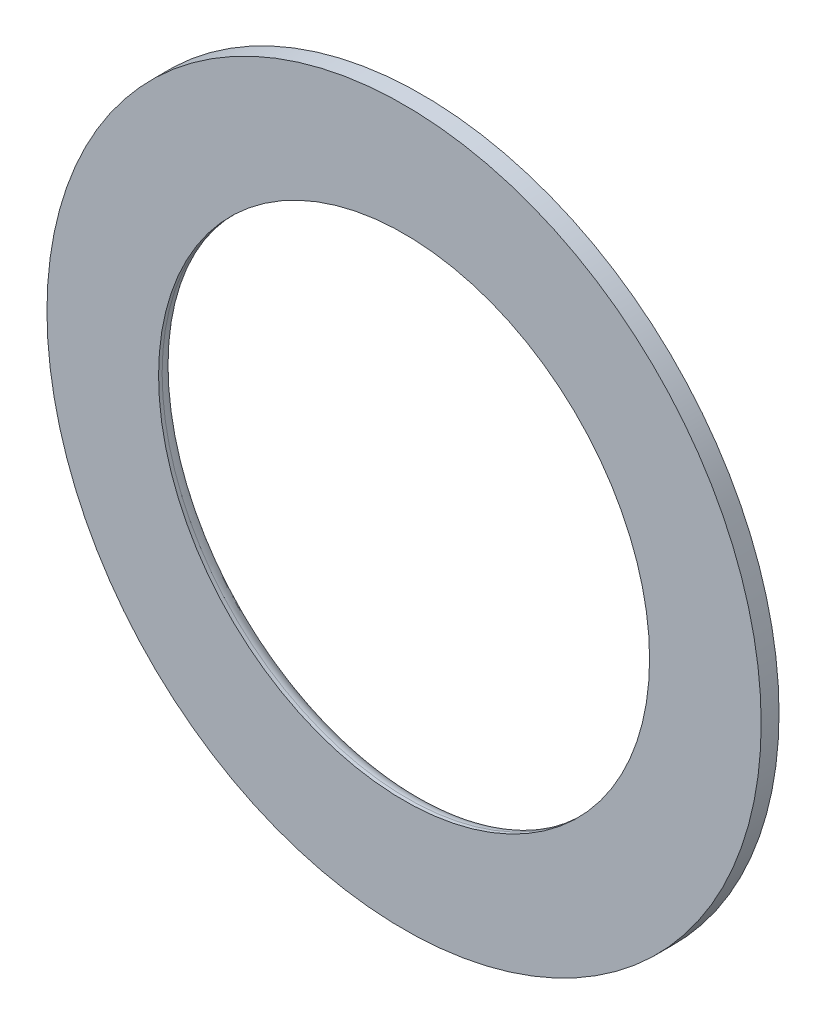
ISO-10303-21;
HEADER;
FILE_DESCRIPTION(('STEP AP214'),'2;1');
FILE_NAME('part.step','',(''),(''),'','','');
FILE_SCHEMA(('AUTOMOTIVE_DESIGN { 1 0 10303 214 1 1 1 1 }'));
ENDSEC;
DATA;
#1=APPLICATION_CONTEXT('core data for automotive mechanical design processes');
#2=APPLICATION_PROTOCOL_DEFINITION('international standard','automotive_design',2000,#1);
#3=PRODUCT_CONTEXT('',#1,'mechanical');
#4=PRODUCT('Part','Part','',(#3));
#5=PRODUCT_RELATED_PRODUCT_CATEGORY('part','',(#4));
#6=PRODUCT_DEFINITION_FORMATION('','',#4);
#7=PRODUCT_DEFINITION_CONTEXT('part definition',#1,'design');
#8=PRODUCT_DEFINITION('design','',#6,#7);
#9=PRODUCT_DEFINITION_SHAPE('','',#8);
#10=(LENGTH_UNIT() NAMED_UNIT(*) SI_UNIT(.MILLI.,.METRE.));
#11=(NAMED_UNIT(*) PLANE_ANGLE_UNIT() SI_UNIT($,.RADIAN.));
#12=(NAMED_UNIT(*) SI_UNIT($,.STERADIAN.) SOLID_ANGLE_UNIT());
#13=UNCERTAINTY_MEASURE_WITH_UNIT(LENGTH_MEASURE(1.E-05),#10,'distance_accuracy_value','');
#14=(GEOMETRIC_REPRESENTATION_CONTEXT(3) GLOBAL_UNCERTAINTY_ASSIGNED_CONTEXT((#13)) GLOBAL_UNIT_ASSIGNED_CONTEXT((#10,
#11,#12)) REPRESENTATION_CONTEXT('',''));
#15=CARTESIAN_POINT('',(0.,0.,0.));
#16=DIRECTION('',(0.,0.,1.));
#17=DIRECTION('',(1.,0.,0.));
#18=AXIS2_PLACEMENT_3D('',#15,#16,#17);
#19=CARTESIAN_POINT('',(0.,0.,2.));
#20=DIRECTION('',(0.,0.,1.));
#21=DIRECTION('',(1.,0.,0.));
#22=AXIS2_PLACEMENT_3D('',#19,#20,#21);
#23=PLANE('',#22);
#24=CARTESIAN_POINT('',(0.,0.,2.));
#25=DIRECTION('',(0.,0.,1.));
#26=DIRECTION('',(1.,0.,0.));
#27=AXIS2_PLACEMENT_3D('',#24,#25,#26);
#28=CIRCLE('',#27,40.);
#29=CARTESIAN_POINT('',(40.,0.,2.));
#30=VERTEX_POINT('',#29);
#31=EDGE_CURVE('E54',#30,#30,#28,.T.);
#32=ORIENTED_EDGE('',*,*,#31,.T.);
#33=EDGE_LOOP('',(#32));
#34=FACE_BOUND('',#33,.T.);
#35=CARTESIAN_POINT('',(0.,0.,2.));
#36=DIRECTION('',(0.,0.,1.));
#37=DIRECTION('',(1.,0.,0.));
#38=AXIS2_PLACEMENT_3D('',#35,#36,#37);
#39=CIRCLE('',#38,27.5);
#40=CARTESIAN_POINT('',(27.5,0.,2.));
#41=VERTEX_POINT('',#40);
#42=EDGE_CURVE('E64',#41,#41,#39,.T.);
#43=ORIENTED_EDGE('',*,*,#42,.F.);
#44=EDGE_LOOP('',(#43));
#45=FACE_BOUND('',#44,.T.);
#46=ADVANCED_FACE('F41',(#34,#45),#23,.T.);
#47=CARTESIAN_POINT('',(0.,0.,0.));
#48=DIRECTION('',(0.,0.,1.));
#49=DIRECTION('',(1.,0.,0.));
#50=AXIS2_PLACEMENT_3D('',#47,#48,#49);
#51=PLANE('',#50);
#52=CARTESIAN_POINT('',(0.,0.,0.));
#53=DIRECTION('',(0.,0.,1.));
#54=DIRECTION('',(1.,0.,0.));
#55=AXIS2_PLACEMENT_3D('',#52,#53,#54);
#56=CIRCLE('',#55,29.1);
#57=CARTESIAN_POINT('',(29.1,0.,0.));
#58=VERTEX_POINT('',#57);
#59=EDGE_CURVE('E49',#58,#58,#56,.T.);
#60=ORIENTED_EDGE('',*,*,#59,.T.);
#61=EDGE_LOOP('',(#60));
#62=FACE_BOUND('',#61,.T.);
#63=CARTESIAN_POINT('',(0.,0.,0.));
#64=DIRECTION('',(0.,0.,1.));
#65=DIRECTION('',(1.,0.,0.));
#66=AXIS2_PLACEMENT_3D('',#63,#64,#65);
#67=CIRCLE('',#66,40.);
#68=CARTESIAN_POINT('',(40.,0.,0.));
#69=VERTEX_POINT('',#68);
#70=EDGE_CURVE('E59',#69,#69,#67,.T.);
#71=ORIENTED_EDGE('',*,*,#70,.F.);
#72=EDGE_LOOP('',(#71));
#73=FACE_BOUND('',#72,.T.);
#74=ADVANCED_FACE('F73',(#62,#73),#51,.F.);
#75=CARTESIAN_POINT('',(0.,0.,2.));
#76=DIRECTION('',(0.,0.,-1.));
#77=DIRECTION('',(-1.,0.,0.));
#78=AXIS2_PLACEMENT_3D('',#75,#76,#77);
#79=CYLINDRICAL_SURFACE('',#78,40.);
#80=ORIENTED_EDGE('',*,*,#31,.F.);
#81=EDGE_LOOP('',(#80));
#82=FACE_BOUND('',#81,.T.);
#83=ORIENTED_EDGE('',*,*,#70,.T.);
#84=EDGE_LOOP('',(#83));
#85=FACE_BOUND('',#84,.T.);
#86=ADVANCED_FACE('F79',(#82,#85),#79,.T.);
#87=CARTESIAN_POINT('',(0.,0.,2.));
#88=DIRECTION('',(0.,0.,-1.));
#89=DIRECTION('',(-1.,0.,0.));
#90=AXIS2_PLACEMENT_3D('',#87,#88,#89);
#91=CYLINDRICAL_SURFACE('',#90,27.5);
#92=CARTESIAN_POINT('',(0.,0.,1.6));
#93=DIRECTION('',(0.,0.,1.));
#94=DIRECTION('',(1.,0.,0.));
#95=AXIS2_PLACEMENT_3D('',#92,#93,#94);
#96=CIRCLE('',#95,27.5);
#97=CARTESIAN_POINT('',(27.5,0.,1.6));
#98=VERTEX_POINT('',#97);
#99=EDGE_CURVE('E10',#98,#98,#96,.F.);
#100=ORIENTED_EDGE('',*,*,#99,.T.);
#101=EDGE_LOOP('',(#100));
#102=FACE_BOUND('',#101,.T.);
#103=ORIENTED_EDGE('',*,*,#42,.T.);
#104=EDGE_LOOP('',(#103));
#105=FACE_BOUND('',#104,.T.);
#106=ADVANCED_FACE('F70',(#102,#105),#91,.F.);
#107=CARTESIAN_POINT('',(0.,0.,1.6));
#108=DIRECTION('',(0.,0.,1.));
#109=DIRECTION('',(1.,0.,0.));
#110=AXIS2_PLACEMENT_3D('',#107,#108,#109);
#111=TOROIDAL_SURFACE('',#110,29.1,1.6);
#112=ORIENTED_EDGE('',*,*,#99,.F.);
#113=EDGE_LOOP('',(#112));
#114=FACE_BOUND('',#113,.T.);
#115=ORIENTED_EDGE('',*,*,#59,.F.);
#116=EDGE_LOOP('',(#115));
#117=FACE_BOUND('',#116,.T.);
#118=ADVANCED_FACE('F43',(#114,#117),#111,.T.);
#119=CLOSED_SHELL('',(#46,#74,#86,#106,#118));
#120=MANIFOLD_SOLID_BREP('B2',#119);
#121=ADVANCED_BREP_SHAPE_REPRESENTATION('',(#18,#120),#14);
#122=SHAPE_DEFINITION_REPRESENTATION(#9,#121);
ENDSEC;
END-ISO-10303-21;
